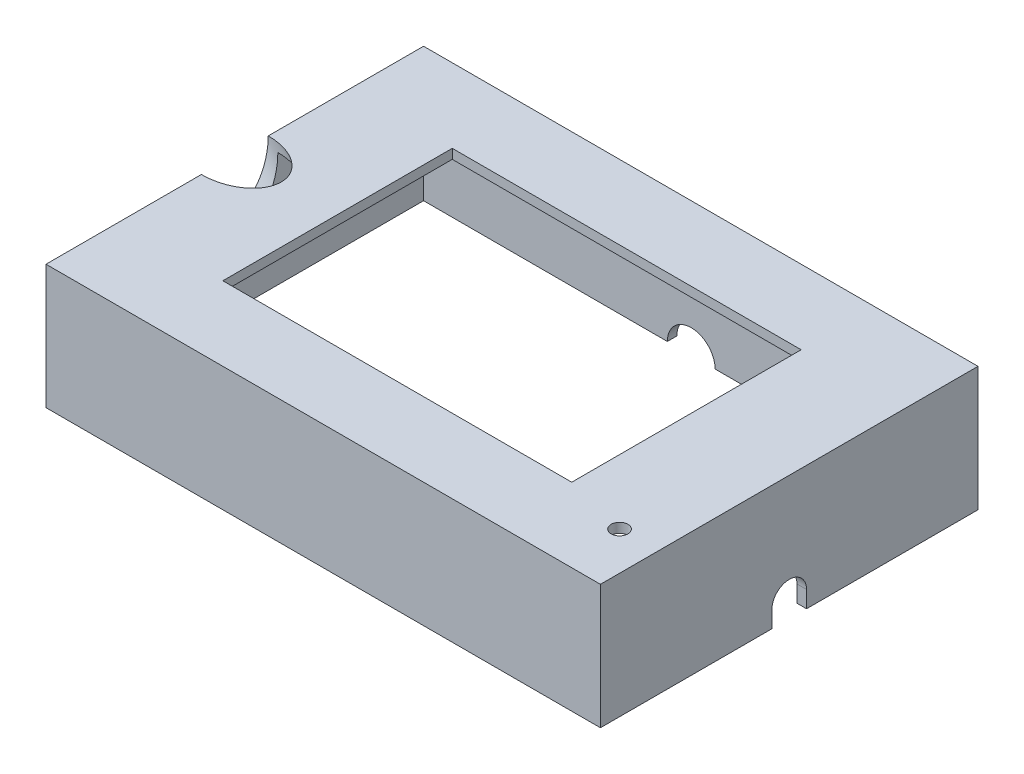
ISO-10303-21;
HEADER;
FILE_DESCRIPTION(('STEP AP214'),'2;1');
FILE_NAME('part.step','',(''),(''),'','','');
FILE_SCHEMA(('AUTOMOTIVE_DESIGN { 1 0 10303 214 1 1 1 1 }'));
ENDSEC;
DATA;
#1=APPLICATION_CONTEXT('core data for automotive mechanical design processes');
#2=APPLICATION_PROTOCOL_DEFINITION('international standard','automotive_design',2000,#1);
#3=PRODUCT_CONTEXT('',#1,'mechanical');
#4=PRODUCT('Part','Part','',(#3));
#5=PRODUCT_RELATED_PRODUCT_CATEGORY('part','',(#4));
#6=PRODUCT_DEFINITION_FORMATION('','',#4);
#7=PRODUCT_DEFINITION_CONTEXT('part definition',#1,'design');
#8=PRODUCT_DEFINITION('design','',#6,#7);
#9=PRODUCT_DEFINITION_SHAPE('','',#8);
#10=(LENGTH_UNIT() NAMED_UNIT(*) SI_UNIT(.MILLI.,.METRE.));
#11=(NAMED_UNIT(*) PLANE_ANGLE_UNIT() SI_UNIT($,.RADIAN.));
#12=(NAMED_UNIT(*) SI_UNIT($,.STERADIAN.) SOLID_ANGLE_UNIT());
#13=UNCERTAINTY_MEASURE_WITH_UNIT(LENGTH_MEASURE(1.E-05),#10,'distance_accuracy_value','');
#14=(GEOMETRIC_REPRESENTATION_CONTEXT(3) GLOBAL_UNCERTAINTY_ASSIGNED_CONTEXT((#13)) GLOBAL_UNIT_ASSIGNED_CONTEXT((#10,
#11,#12)) REPRESENTATION_CONTEXT('',''));
#15=CARTESIAN_POINT('',(0.,0.,0.));
#16=DIRECTION('',(0.,0.,1.));
#17=DIRECTION('',(1.,0.,0.));
#18=AXIS2_PLACEMENT_3D('',#15,#16,#17);
#19=CARTESIAN_POINT('',(0.,0.,0.));
#20=DIRECTION('',(0.,1.,0.));
#21=DIRECTION('',(0.,0.,1.));
#22=AXIS2_PLACEMENT_3D('',#19,#20,#21);
#23=PLANE('',#22);
#24=DIRECTION('',(-1.,0.,0.));
#25=VECTOR('',#24,1.);
#26=CARTESIAN_POINT('',(56.,0.,-37.5));
#27=LINE('',#26,#25);
#28=CARTESIAN_POINT('',(56.,0.,-37.5));
#29=VERTEX_POINT('',#28);
#30=CARTESIAN_POINT('',(5.,0.,-37.5));
#31=VERTEX_POINT('',#30);
#32=EDGE_CURVE('E313',#29,#31,#27,.T.);
#33=ORIENTED_EDGE('',*,*,#32,.T.);
#34=DIRECTION('',(0.,0.,-1.));
#35=VECTOR('',#34,1.);
#36=CARTESIAN_POINT('',(5.,0.,-23.357864376269));
#37=LINE('',#36,#35);
#38=CARTESIAN_POINT('',(5.,0.,-39.5));
#39=VERTEX_POINT('',#38);
#40=EDGE_CURVE('E47',#31,#39,#37,.T.);
#41=ORIENTED_EDGE('',*,*,#40,.T.);
#42=DIRECTION('',(-1.,0.,0.));
#43=VECTOR('',#42,1.);
#44=CARTESIAN_POINT('',(58.,0.,-39.5));
#45=LINE('',#44,#43);
#46=CARTESIAN_POINT('',(58.,0.,-39.5));
#47=VERTEX_POINT('',#46);
#48=EDGE_CURVE('E188',#47,#39,#45,.T.);
#49=ORIENTED_EDGE('',*,*,#48,.F.);
#50=DIRECTION('',(0.,0.,-1.));
#51=VECTOR('',#50,1.);
#52=CARTESIAN_POINT('',(58.,0.,39.5));
#53=LINE('',#52,#51);
#54=CARTESIAN_POINT('',(58.,0.,-3.625));
#55=VERTEX_POINT('',#54);
#56=EDGE_CURVE('E197',#55,#47,#53,.T.);
#57=ORIENTED_EDGE('',*,*,#56,.F.);
#58=DIRECTION('',(1.,0.,0.));
#59=VECTOR('',#58,1.);
#60=CARTESIAN_POINT('',(45.834955730544,0.,-3.625));
#61=LINE('',#60,#59);
#62=CARTESIAN_POINT('',(56.,0.,-3.625));
#63=VERTEX_POINT('',#62);
#64=EDGE_CURVE('E350',#63,#55,#61,.T.);
#65=ORIENTED_EDGE('',*,*,#64,.F.);
#66=DIRECTION('',(0.,0.,-1.));
#67=VECTOR('',#66,1.);
#68=CARTESIAN_POINT('',(56.,0.,37.5));
#69=LINE('',#68,#67);
#70=EDGE_CURVE('E308',#63,#29,#69,.T.);
#71=ORIENTED_EDGE('',*,*,#70,.T.);
#72=EDGE_LOOP('',(#33,#41,#49,#57,#65,#71));
#73=FACE_BOUND('',#72,.T.);
#74=ADVANCED_FACE('F33',(#73),#23,.F.);
#75=CARTESIAN_POINT('',(-58.,24.,39.5));
#76=DIRECTION('',(1.,0.,0.));
#77=DIRECTION('',(0.,0.,-1.));
#78=AXIS2_PLACEMENT_3D('',#75,#76,#77);
#79=PLANE('',#78);
#80=CARTESIAN_POINT('',(-58.,26.,0.));
#81=DIRECTION('',(1.,0.,0.));
#82=DIRECTION('',(0.,1.,0.));
#83=AXIS2_PLACEMENT_3D('',#80,#81,#82);
#84=ELLIPSE('',#83,10.0916656690722,7.);
#85=CARTESIAN_POINT('',(-58.,26.,-7.));
#86=VERTEX_POINT('',#85);
#87=CARTESIAN_POINT('',(-58.,26.,7.));
#88=VERTEX_POINT('',#87);
#89=EDGE_CURVE('E231',#86,#88,#84,.F.);
#90=ORIENTED_EDGE('',*,*,#89,.F.);
#91=DIRECTION('',(0.,0.,1.));
#92=VECTOR('',#91,1.);
#93=CARTESIAN_POINT('',(-58.,26.,39.5));
#94=LINE('',#93,#92);
#95=CARTESIAN_POINT('',(-58.,26.,-39.5));
#96=VERTEX_POINT('',#95);
#97=EDGE_CURVE('E278',#96,#86,#94,.T.);
#98=ORIENTED_EDGE('',*,*,#97,.F.);
#99=DIRECTION('',(0.,-1.,0.));
#100=VECTOR('',#99,1.);
#101=CARTESIAN_POINT('',(-58.,24.,-39.5));
#102=LINE('',#101,#100);
#103=CARTESIAN_POINT('',(-58.,0.,-39.5));
#104=VERTEX_POINT('',#103);
#105=EDGE_CURVE('E210',#96,#104,#102,.T.);
#106=ORIENTED_EDGE('',*,*,#105,.T.);
#107=DIRECTION('',(0.,0.,1.));
#108=VECTOR('',#107,1.);
#109=CARTESIAN_POINT('',(-58.,0.,39.5));
#110=LINE('',#109,#108);
#111=CARTESIAN_POINT('',(-58.,0.,39.5));
#112=VERTEX_POINT('',#111);
#113=EDGE_CURVE('E193',#104,#112,#110,.T.);
#114=ORIENTED_EDGE('',*,*,#113,.T.);
#115=DIRECTION('',(0.,-1.,0.));
#116=VECTOR('',#115,1.);
#117=CARTESIAN_POINT('',(-58.,24.,39.5));
#118=LINE('',#117,#116);
#119=CARTESIAN_POINT('',(-58.,26.,39.5));
#120=VERTEX_POINT('',#119);
#121=EDGE_CURVE('E207',#120,#112,#118,.T.);
#122=ORIENTED_EDGE('',*,*,#121,.F.);
#123=EDGE_CURVE('E277',#88,#120,#94,.T.);
#124=ORIENTED_EDGE('',*,*,#123,.F.);
#125=EDGE_LOOP('',(#90,#98,#106,#114,#122,#124));
#126=FACE_BOUND('',#125,.T.);
#127=ADVANCED_FACE('F341',(#126),#79,.F.);
#128=CARTESIAN_POINT('',(-56.,24.,37.5));
#129=DIRECTION('',(1.,0.,0.));
#130=DIRECTION('',(0.,0.,-1.));
#131=AXIS2_PLACEMENT_3D('',#128,#129,#130);
#132=PLANE('',#131);
#133=DIRECTION('',(0.,0.,1.));
#134=VECTOR('',#133,1.);
#135=CARTESIAN_POINT('',(-56.,24.,37.5));
#136=LINE('',#135,#134);
#137=CARTESIAN_POINT('',(-56.,24.,-37.5));
#138=VERTEX_POINT('',#137);
#139=CARTESIAN_POINT('',(-56.,24.,-6.9997966416826));
#140=VERTEX_POINT('',#139);
#141=EDGE_CURVE('E236',#138,#140,#136,.T.);
#142=ORIENTED_EDGE('',*,*,#141,.T.);
#143=CARTESIAN_POINT('',(-56.,23.9230769230769,0.));
#144=DIRECTION('',(1.,0.,0.));
#145=DIRECTION('',(0.,1.,0.));
#146=AXIS2_PLACEMENT_3D('',#143,#144,#145);
#147=ELLIPSE('',#146,10.0916656690722,7.);
#148=CARTESIAN_POINT('',(-56.,14.0432112488953,-1.42660532785244));
#149=VERTEX_POINT('',#148);
#150=EDGE_CURVE('E228',#140,#149,#147,.F.);
#151=ORIENTED_EDGE('',*,*,#150,.T.);
#152=DIRECTION('',(0.,0.,-1.));
#153=VECTOR('',#152,1.);
#154=CARTESIAN_POINT('',(-56.,14.0432112488953,37.5));
#155=LINE('',#154,#153);
#156=CARTESIAN_POINT('',(-56.,14.0432112488953,1.42660532785244));
#157=VERTEX_POINT('',#156);
#158=EDGE_CURVE('E41',#157,#149,#155,.T.);
#159=ORIENTED_EDGE('',*,*,#158,.F.);
#160=CARTESIAN_POINT('',(-56.,24.,6.9997966416826));
#161=VERTEX_POINT('',#160);
#162=EDGE_CURVE('E230',#157,#161,#147,.F.);
#163=ORIENTED_EDGE('',*,*,#162,.T.);
#164=CARTESIAN_POINT('',(-56.,24.,37.5));
#165=VERTEX_POINT('',#164);
#166=EDGE_CURVE('E293',#161,#165,#136,.T.);
#167=ORIENTED_EDGE('',*,*,#166,.T.);
#168=DIRECTION('',(0.,-1.,0.));
#169=VECTOR('',#168,1.);
#170=CARTESIAN_POINT('',(-56.,24.,37.5));
#171=LINE('',#170,#169);
#172=CARTESIAN_POINT('',(-56.,0.,37.5));
#173=VERTEX_POINT('',#172);
#174=EDGE_CURVE('E322',#165,#173,#171,.T.);
#175=ORIENTED_EDGE('',*,*,#174,.T.);
#176=DIRECTION('',(0.,0.,1.));
#177=VECTOR('',#176,1.);
#178=CARTESIAN_POINT('',(-56.,0.,37.5));
#179=LINE('',#178,#177);
#180=CARTESIAN_POINT('',(-56.,0.,-37.5));
#181=VERTEX_POINT('',#180);
#182=EDGE_CURVE('E290',#181,#173,#179,.T.);
#183=ORIENTED_EDGE('',*,*,#182,.F.);
#184=DIRECTION('',(0.,-1.,0.));
#185=VECTOR('',#184,1.);
#186=CARTESIAN_POINT('',(-56.,24.,-37.5));
#187=LINE('',#186,#185);
#188=EDGE_CURVE('E302',#138,#181,#187,.T.);
#189=ORIENTED_EDGE('',*,*,#188,.F.);
#190=EDGE_LOOP('',(#142,#151,#159,#163,#167,#175,#183,#189));
#191=FACE_BOUND('',#190,.T.);
#192=ADVANCED_FACE('F234',(#191),#132,.T.);
#193=CARTESIAN_POINT('',(0.,24.,0.));
#194=DIRECTION('',(0.,1.,0.));
#195=DIRECTION('',(0.,0.,1.));
#196=AXIS2_PLACEMENT_3D('',#193,#194,#195);
#197=PLANE('',#196);
#198=DIRECTION('',(-1.,0.,0.));
#199=VECTOR('',#198,1.);
#200=CARTESIAN_POINT('',(-36.5,24.,24.));
#201=LINE('',#200,#199);
#202=CARTESIAN_POINT('',(36.5,24.,24.));
#203=VERTEX_POINT('',#202);
#204=CARTESIAN_POINT('',(-36.5,24.,24.));
#205=VERTEX_POINT('',#204);
#206=EDGE_CURVE('E252',#203,#205,#201,.T.);
#207=ORIENTED_EDGE('',*,*,#206,.F.);
#208=DIRECTION('',(0.,0.,1.));
#209=VECTOR('',#208,1.);
#210=CARTESIAN_POINT('',(36.5,24.,-24.));
#211=LINE('',#210,#209);
#212=CARTESIAN_POINT('',(36.5,24.,-24.));
#213=VERTEX_POINT('',#212);
#214=EDGE_CURVE('E255',#213,#203,#211,.T.);
#215=ORIENTED_EDGE('',*,*,#214,.F.);
#216=DIRECTION('',(1.,0.,0.));
#217=VECTOR('',#216,1.);
#218=CARTESIAN_POINT('',(-36.5,24.,-24.));
#219=LINE('',#218,#217);
#220=CARTESIAN_POINT('',(-36.5,24.,-24.));
#221=VERTEX_POINT('',#220);
#222=EDGE_CURVE('E257',#221,#213,#219,.T.);
#223=ORIENTED_EDGE('',*,*,#222,.F.);
#224=DIRECTION('',(0.,0.,-1.));
#225=VECTOR('',#224,1.);
#226=CARTESIAN_POINT('',(-36.5,24.,-24.));
#227=LINE('',#226,#225);
#228=EDGE_CURVE('E249',#205,#221,#227,.T.);
#229=ORIENTED_EDGE('',*,*,#228,.F.);
#230=EDGE_LOOP('',(#207,#215,#223,#229));
#231=FACE_BOUND('',#230,.T.);
#232=CARTESIAN_POINT('',(50.,24.,27.5));
#233=DIRECTION('',(0.,1.,0.));
#234=DIRECTION('',(0.,0.,1.));
#235=AXIS2_PLACEMENT_3D('',#232,#233,#234);
#236=CIRCLE('',#235,1.75);
#237=CARTESIAN_POINT('',(50.,24.,29.25));
#238=VERTEX_POINT('',#237);
#239=EDGE_CURVE('E240',#238,#238,#236,.F.);
#240=ORIENTED_EDGE('',*,*,#239,.F.);
#241=EDGE_LOOP('',(#240));
#242=FACE_BOUND('',#241,.T.);
#243=CARTESIAN_POINT('',(-56.0740740740741,24.,0.));
#244=DIRECTION('',(0.,1.,0.));
#245=DIRECTION('',(-1.,0.,0.));
#246=AXIS2_PLACEMENT_3D('',#243,#244,#245);
#247=ELLIPSE('',#246,9.71790027392142,7.);
#248=EDGE_CURVE('E242',#140,#161,#247,.F.);
#249=ORIENTED_EDGE('',*,*,#248,.F.);
#250=ORIENTED_EDGE('',*,*,#141,.F.);
#251=DIRECTION('',(-1.,0.,0.));
#252=VECTOR('',#251,1.);
#253=CARTESIAN_POINT('',(56.,24.,-37.5));
#254=LINE('',#253,#252);
#255=CARTESIAN_POINT('',(56.,24.,-37.5));
#256=VERTEX_POINT('',#255);
#257=EDGE_CURVE('E299',#256,#138,#254,.T.);
#258=ORIENTED_EDGE('',*,*,#257,.F.);
#259=DIRECTION('',(0.,0.,-1.));
#260=VECTOR('',#259,1.);
#261=CARTESIAN_POINT('',(56.,24.,37.5));
#262=LINE('',#261,#260);
#263=CARTESIAN_POINT('',(56.,24.,37.5));
#264=VERTEX_POINT('',#263);
#265=EDGE_CURVE('E296',#264,#256,#262,.T.);
#266=ORIENTED_EDGE('',*,*,#265,.F.);
#267=DIRECTION('',(1.,0.,0.));
#268=VECTOR('',#267,1.);
#269=CARTESIAN_POINT('',(56.,24.,37.5));
#270=LINE('',#269,#268);
#271=EDGE_CURVE('E292',#165,#264,#270,.T.);
#272=ORIENTED_EDGE('',*,*,#271,.F.);
#273=ORIENTED_EDGE('',*,*,#166,.F.);
#274=EDGE_LOOP('',(#249,#250,#258,#266,#272,#273));
#275=FACE_BOUND('',#274,.T.);
#276=ADVANCED_FACE('F386',(#231,#242,#275),#197,.F.);
#277=CARTESIAN_POINT('',(0.,26.,0.));
#278=DIRECTION('',(0.,1.,0.));
#279=DIRECTION('',(0.,0.,1.));
#280=AXIS2_PLACEMENT_3D('',#277,#278,#279);
#281=PLANE('',#280);
#282=DIRECTION('',(0.,0.,-1.));
#283=VECTOR('',#282,1.);
#284=CARTESIAN_POINT('',(36.5,26.,-24.));
#285=LINE('',#284,#283);
#286=CARTESIAN_POINT('',(36.5,26.,24.));
#287=VERTEX_POINT('',#286);
#288=CARTESIAN_POINT('',(36.5,26.,-24.));
#289=VERTEX_POINT('',#288);
#290=EDGE_CURVE('E248',#287,#289,#285,.T.);
#291=ORIENTED_EDGE('',*,*,#290,.F.);
#292=DIRECTION('',(1.,0.,0.));
#293=VECTOR('',#292,1.);
#294=CARTESIAN_POINT('',(-36.5,26.,24.));
#295=LINE('',#294,#293);
#296=CARTESIAN_POINT('',(-36.5,26.,24.));
#297=VERTEX_POINT('',#296);
#298=EDGE_CURVE('E265',#297,#287,#295,.T.);
#299=ORIENTED_EDGE('',*,*,#298,.F.);
#300=DIRECTION('',(0.,0.,1.));
#301=VECTOR('',#300,1.);
#302=CARTESIAN_POINT('',(-36.5,26.,-24.));
#303=LINE('',#302,#301);
#304=CARTESIAN_POINT('',(-36.5,26.,-24.));
#305=VERTEX_POINT('',#304);
#306=EDGE_CURVE('E262',#305,#297,#303,.T.);
#307=ORIENTED_EDGE('',*,*,#306,.F.);
#308=DIRECTION('',(-1.,0.,0.));
#309=VECTOR('',#308,1.);
#310=CARTESIAN_POINT('',(-36.5,26.,-24.));
#311=LINE('',#310,#309);
#312=EDGE_CURVE('E259',#289,#305,#311,.T.);
#313=ORIENTED_EDGE('',*,*,#312,.F.);
#314=EDGE_LOOP('',(#291,#299,#307,#313));
#315=FACE_BOUND('',#314,.T.);
#316=CARTESIAN_POINT('',(50.,26.,27.5));
#317=DIRECTION('',(0.,1.,0.));
#318=DIRECTION('',(0.,0.,1.));
#319=AXIS2_PLACEMENT_3D('',#316,#317,#318);
#320=CIRCLE('',#319,1.75);
#321=CARTESIAN_POINT('',(50.,26.,29.25));
#322=VERTEX_POINT('',#321);
#323=EDGE_CURVE('E237',#322,#322,#320,.T.);
#324=ORIENTED_EDGE('',*,*,#323,.F.);
#325=EDGE_LOOP('',(#324));
#326=FACE_BOUND('',#325,.T.);
#327=ORIENTED_EDGE('',*,*,#97,.T.);
#328=CARTESIAN_POINT('',(-58.,26.,0.));
#329=DIRECTION('',(0.,1.,0.));
#330=DIRECTION('',(-1.,0.,0.));
#331=AXIS2_PLACEMENT_3D('',#328,#329,#330);
#332=ELLIPSE('',#331,9.71790027392142,7.);
#333=EDGE_CURVE('E214',#86,#88,#332,.F.);
#334=ORIENTED_EDGE('',*,*,#333,.T.);
#335=ORIENTED_EDGE('',*,*,#123,.T.);
#336=DIRECTION('',(1.,0.,0.));
#337=VECTOR('',#336,1.);
#338=CARTESIAN_POINT('',(58.,26.,39.5));
#339=LINE('',#338,#337);
#340=CARTESIAN_POINT('',(58.,26.,39.5));
#341=VERTEX_POINT('',#340);
#342=EDGE_CURVE('E281',#120,#341,#339,.T.);
#343=ORIENTED_EDGE('',*,*,#342,.T.);
#344=DIRECTION('',(0.,0.,-1.));
#345=VECTOR('',#344,1.);
#346=CARTESIAN_POINT('',(58.,26.,39.5));
#347=LINE('',#346,#345);
#348=CARTESIAN_POINT('',(58.,26.,-39.5));
#349=VERTEX_POINT('',#348);
#350=EDGE_CURVE('E284',#341,#349,#347,.T.);
#351=ORIENTED_EDGE('',*,*,#350,.T.);
#352=DIRECTION('',(-1.,0.,0.));
#353=VECTOR('',#352,1.);
#354=CARTESIAN_POINT('',(58.,26.,-39.5));
#355=LINE('',#354,#353);
#356=EDGE_CURVE('E287',#349,#96,#355,.T.);
#357=ORIENTED_EDGE('',*,*,#356,.T.);
#358=EDGE_LOOP('',(#327,#334,#335,#343,#351,#357));
#359=FACE_BOUND('',#358,.T.);
#360=ADVANCED_FACE('F338',(#315,#326,#359),#281,.T.);
#361=CARTESIAN_POINT('',(-5.,0.,-39.5));
#362=VERTEX_POINT('',#361);
#363=EDGE_CURVE('E184',#362,#104,#45,.T.);
#364=ORIENTED_EDGE('',*,*,#363,.F.);
#365=DIRECTION('',(0.,0.,-1.));
#366=VECTOR('',#365,1.);
#367=CARTESIAN_POINT('',(-5.,0.,-23.357864376269));
#368=LINE('',#367,#366);
#369=CARTESIAN_POINT('',(-5.,0.,-37.5));
#370=VERTEX_POINT('',#369);
#371=EDGE_CURVE('E173',#362,#370,#368,.F.);
#372=ORIENTED_EDGE('',*,*,#371,.T.);
#373=EDGE_CURVE('E312',#370,#181,#27,.T.);
#374=ORIENTED_EDGE('',*,*,#373,.T.);
#375=ORIENTED_EDGE('',*,*,#182,.T.);
#376=DIRECTION('',(1.,0.,0.));
#377=VECTOR('',#376,1.);
#378=CARTESIAN_POINT('',(56.,0.,37.5));
#379=LINE('',#378,#377);
#380=CARTESIAN_POINT('',(56.,0.,37.5));
#381=VERTEX_POINT('',#380);
#382=EDGE_CURVE('E305',#173,#381,#379,.T.);
#383=ORIENTED_EDGE('',*,*,#382,.T.);
#384=CARTESIAN_POINT('',(56.,0.,3.625));
#385=VERTEX_POINT('',#384);
#386=EDGE_CURVE('E309',#381,#385,#69,.T.);
#387=ORIENTED_EDGE('',*,*,#386,.T.);
#388=DIRECTION('',(1.,0.,0.));
#389=VECTOR('',#388,1.);
#390=CARTESIAN_POINT('',(45.834955730544,0.,3.625));
#391=LINE('',#390,#389);
#392=CARTESIAN_POINT('',(58.,0.,3.625));
#393=VERTEX_POINT('',#392);
#394=EDGE_CURVE('E347',#385,#393,#391,.T.);
#395=ORIENTED_EDGE('',*,*,#394,.T.);
#396=CARTESIAN_POINT('',(58.,0.,39.5));
#397=VERTEX_POINT('',#396);
#398=EDGE_CURVE('E194',#397,#393,#53,.T.);
#399=ORIENTED_EDGE('',*,*,#398,.F.);
#400=DIRECTION('',(1.,0.,0.));
#401=VECTOR('',#400,1.);
#402=CARTESIAN_POINT('',(58.,0.,39.5));
#403=LINE('',#402,#401);
#404=EDGE_CURVE('E202',#112,#397,#403,.T.);
#405=ORIENTED_EDGE('',*,*,#404,.F.);
#406=ORIENTED_EDGE('',*,*,#113,.F.);
#407=EDGE_LOOP('',(#364,#372,#374,#375,#383,#387,#395,#399,#405,#406));
#408=FACE_BOUND('',#407,.T.);
#409=ADVANCED_FACE('F191',(#408),#23,.F.);
#410=CARTESIAN_POINT('',(58.,24.,39.5));
#411=DIRECTION('',(-1.,0.,0.));
#412=DIRECTION('',(0.,0.,1.));
#413=AXIS2_PLACEMENT_3D('',#410,#411,#412);
#414=PLANE('',#413);
#415=ORIENTED_EDGE('',*,*,#398,.T.);
#416=DIRECTION('',(0.,-1.,0.));
#417=VECTOR('',#416,1.);
#418=CARTESIAN_POINT('',(58.,3.5,3.625));
#419=LINE('',#418,#417);
#420=CARTESIAN_POINT('',(58.,3.5,3.625));
#421=VERTEX_POINT('',#420);
#422=EDGE_CURVE('E364',#421,#393,#419,.T.);
#423=ORIENTED_EDGE('',*,*,#422,.F.);
#424=CARTESIAN_POINT('',(58.,3.5,0.));
#425=DIRECTION('',(1.,0.,0.));
#426=DIRECTION('',(0.,0.,-1.));
#427=AXIS2_PLACEMENT_3D('',#424,#425,#426);
#428=CIRCLE('',#427,3.625);
#429=CARTESIAN_POINT('',(58.,3.5,-3.625));
#430=VERTEX_POINT('',#429);
#431=EDGE_CURVE('E362',#430,#421,#428,.T.);
#432=ORIENTED_EDGE('',*,*,#431,.F.);
#433=DIRECTION('',(0.,1.,0.));
#434=VECTOR('',#433,1.);
#435=CARTESIAN_POINT('',(58.,3.5,-3.625));
#436=LINE('',#435,#434);
#437=EDGE_CURVE('E332',#55,#430,#436,.T.);
#438=ORIENTED_EDGE('',*,*,#437,.F.);
#439=ORIENTED_EDGE('',*,*,#56,.T.);
#440=DIRECTION('',(0.,-1.,0.));
#441=VECTOR('',#440,1.);
#442=CARTESIAN_POINT('',(58.,24.,-39.5));
#443=LINE('',#442,#441);
#444=EDGE_CURVE('E212',#349,#47,#443,.T.);
#445=ORIENTED_EDGE('',*,*,#444,.F.);
#446=ORIENTED_EDGE('',*,*,#350,.F.);
#447=DIRECTION('',(0.,-1.,0.));
#448=VECTOR('',#447,1.);
#449=CARTESIAN_POINT('',(58.,24.,39.5));
#450=LINE('',#449,#448);
#451=EDGE_CURVE('E204',#341,#397,#450,.T.);
#452=ORIENTED_EDGE('',*,*,#451,.T.);
#453=EDGE_LOOP('',(#415,#423,#432,#438,#439,#445,#446,#452));
#454=FACE_BOUND('',#453,.T.);
#455=ADVANCED_FACE('F35',(#454),#414,.F.);
#456=CARTESIAN_POINT('',(58.,24.,-39.5));
#457=DIRECTION('',(0.,0.,1.));
#458=DIRECTION('',(1.,0.,0.));
#459=AXIS2_PLACEMENT_3D('',#456,#457,#458);
#460=PLANE('',#459);
#461=ORIENTED_EDGE('',*,*,#48,.T.);
#462=CARTESIAN_POINT('',(0.,0.,-39.5));
#463=DIRECTION('',(0.,0.,-1.));
#464=DIRECTION('',(-1.,0.,0.));
#465=AXIS2_PLACEMENT_3D('',#462,#463,#464);
#466=CIRCLE('',#465,5.);
#467=EDGE_CURVE('E176',#362,#39,#466,.T.);
#468=ORIENTED_EDGE('',*,*,#467,.F.);
#469=ORIENTED_EDGE('',*,*,#363,.T.);
#470=ORIENTED_EDGE('',*,*,#105,.F.);
#471=ORIENTED_EDGE('',*,*,#356,.F.);
#472=ORIENTED_EDGE('',*,*,#444,.T.);
#473=EDGE_LOOP('',(#461,#468,#469,#470,#471,#472));
#474=FACE_BOUND('',#473,.T.);
#475=ADVANCED_FACE('F183',(#474),#460,.F.);
#476=CARTESIAN_POINT('',(58.,24.,39.5));
#477=DIRECTION('',(0.,0.,-1.));
#478=DIRECTION('',(-1.,0.,0.));
#479=AXIS2_PLACEMENT_3D('',#476,#477,#478);
#480=PLANE('',#479);
#481=ORIENTED_EDGE('',*,*,#404,.T.);
#482=ORIENTED_EDGE('',*,*,#451,.F.);
#483=ORIENTED_EDGE('',*,*,#342,.F.);
#484=ORIENTED_EDGE('',*,*,#121,.T.);
#485=EDGE_LOOP('',(#481,#482,#483,#484));
#486=FACE_BOUND('',#485,.T.);
#487=ADVANCED_FACE('F414',(#486),#480,.F.);
#488=CARTESIAN_POINT('',(56.,24.,37.5));
#489=DIRECTION('',(0.,0.,-1.));
#490=DIRECTION('',(-1.,0.,0.));
#491=AXIS2_PLACEMENT_3D('',#488,#489,#490);
#492=PLANE('',#491);
#493=ORIENTED_EDGE('',*,*,#382,.F.);
#494=ORIENTED_EDGE('',*,*,#174,.F.);
#495=ORIENTED_EDGE('',*,*,#271,.T.);
#496=DIRECTION('',(0.,-1.,0.));
#497=VECTOR('',#496,1.);
#498=CARTESIAN_POINT('',(56.,24.,37.5));
#499=LINE('',#498,#497);
#500=EDGE_CURVE('E321',#264,#381,#499,.T.);
#501=ORIENTED_EDGE('',*,*,#500,.T.);
#502=EDGE_LOOP('',(#493,#494,#495,#501));
#503=FACE_BOUND('',#502,.T.);
#504=ADVANCED_FACE('F382',(#503),#492,.T.);
#505=CARTESIAN_POINT('',(56.,24.,37.5));
#506=DIRECTION('',(-1.,0.,0.));
#507=DIRECTION('',(0.,0.,1.));
#508=AXIS2_PLACEMENT_3D('',#505,#506,#507);
#509=PLANE('',#508);
#510=DIRECTION('',(0.,-1.,0.));
#511=VECTOR('',#510,1.);
#512=CARTESIAN_POINT('',(56.,3.5,3.625));
#513=LINE('',#512,#511);
#514=CARTESIAN_POINT('',(56.,3.5,3.625));
#515=VERTEX_POINT('',#514);
#516=EDGE_CURVE('E351',#515,#385,#513,.T.);
#517=ORIENTED_EDGE('',*,*,#516,.T.);
#518=ORIENTED_EDGE('',*,*,#386,.F.);
#519=ORIENTED_EDGE('',*,*,#500,.F.);
#520=ORIENTED_EDGE('',*,*,#265,.T.);
#521=DIRECTION('',(0.,-1.,0.));
#522=VECTOR('',#521,1.);
#523=CARTESIAN_POINT('',(56.,24.,-37.5));
#524=LINE('',#523,#522);
#525=EDGE_CURVE('E318',#256,#29,#524,.T.);
#526=ORIENTED_EDGE('',*,*,#525,.T.);
#527=ORIENTED_EDGE('',*,*,#70,.F.);
#528=DIRECTION('',(0.,1.,0.));
#529=VECTOR('',#528,1.);
#530=CARTESIAN_POINT('',(56.,3.5,-3.625));
#531=LINE('',#530,#529);
#532=CARTESIAN_POINT('',(56.,3.5,-3.625));
#533=VERTEX_POINT('',#532);
#534=EDGE_CURVE('E353',#63,#533,#531,.T.);
#535=ORIENTED_EDGE('',*,*,#534,.T.);
#536=CARTESIAN_POINT('',(56.,3.5,0.));
#537=DIRECTION('',(-1.,0.,0.));
#538=DIRECTION('',(0.,0.,1.));
#539=AXIS2_PLACEMENT_3D('',#536,#537,#538);
#540=CIRCLE('',#539,3.625);
#541=EDGE_CURVE('E346',#533,#515,#540,.F.);
#542=ORIENTED_EDGE('',*,*,#541,.T.);
#543=EDGE_LOOP('',(#517,#518,#519,#520,#526,#527,#535,#542));
#544=FACE_BOUND('',#543,.T.);
#545=ADVANCED_FACE('F373',(#544),#509,.T.);
#546=CARTESIAN_POINT('',(56.,24.,-37.5));
#547=DIRECTION('',(0.,0.,1.));
#548=DIRECTION('',(1.,0.,0.));
#549=AXIS2_PLACEMENT_3D('',#546,#547,#548);
#550=PLANE('',#549);
#551=CARTESIAN_POINT('',(0.,0.,-37.5));
#552=DIRECTION('',(0.,0.,1.));
#553=DIRECTION('',(1.,0.,0.));
#554=AXIS2_PLACEMENT_3D('',#551,#552,#553);
#555=CIRCLE('',#554,5.);
#556=EDGE_CURVE('E11',#31,#370,#555,.T.);
#557=ORIENTED_EDGE('',*,*,#556,.F.);
#558=ORIENTED_EDGE('',*,*,#32,.F.);
#559=ORIENTED_EDGE('',*,*,#525,.F.);
#560=ORIENTED_EDGE('',*,*,#257,.T.);
#561=ORIENTED_EDGE('',*,*,#188,.T.);
#562=ORIENTED_EDGE('',*,*,#373,.F.);
#563=EDGE_LOOP('',(#557,#558,#559,#560,#561,#562));
#564=FACE_BOUND('',#563,.T.);
#565=ADVANCED_FACE('F380',(#564),#550,.T.);
#566=CARTESIAN_POINT('',(36.5,-63.3670418407308,-24.));
#567=DIRECTION('',(1.,0.,0.));
#568=DIRECTION('',(0.,0.,-1.));
#569=AXIS2_PLACEMENT_3D('',#566,#567,#568);
#570=PLANE('',#569);
#571=ORIENTED_EDGE('',*,*,#214,.T.);
#572=DIRECTION('',(0.,1.,0.));
#573=VECTOR('',#572,1.);
#574=CARTESIAN_POINT('',(36.5,-63.3670418407308,24.));
#575=LINE('',#574,#573);
#576=EDGE_CURVE('E253',#203,#287,#575,.T.);
#577=ORIENTED_EDGE('',*,*,#576,.T.);
#578=ORIENTED_EDGE('',*,*,#290,.T.);
#579=DIRECTION('',(0.,1.,0.));
#580=VECTOR('',#579,1.);
#581=CARTESIAN_POINT('',(36.5,-63.3670418407308,-24.));
#582=LINE('',#581,#580);
#583=EDGE_CURVE('E268',#213,#289,#582,.T.);
#584=ORIENTED_EDGE('',*,*,#583,.F.);
#585=EDGE_LOOP('',(#571,#577,#578,#584));
#586=FACE_BOUND('',#585,.T.);
#587=ADVANCED_FACE('F448',(#586),#570,.F.);
#588=CARTESIAN_POINT('',(-36.5,-63.3670418407308,24.));
#589=DIRECTION('',(0.,0.,1.));
#590=DIRECTION('',(1.,0.,0.));
#591=AXIS2_PLACEMENT_3D('',#588,#589,#590);
#592=PLANE('',#591);
#593=ORIENTED_EDGE('',*,*,#206,.T.);
#594=DIRECTION('',(0.,1.,0.));
#595=VECTOR('',#594,1.);
#596=CARTESIAN_POINT('',(-36.5,-63.3670418407308,24.));
#597=LINE('',#596,#595);
#598=EDGE_CURVE('E270',#205,#297,#597,.T.);
#599=ORIENTED_EDGE('',*,*,#598,.T.);
#600=ORIENTED_EDGE('',*,*,#298,.T.);
#601=ORIENTED_EDGE('',*,*,#576,.F.);
#602=EDGE_LOOP('',(#593,#599,#600,#601));
#603=FACE_BOUND('',#602,.T.);
#604=ADVANCED_FACE('F444',(#603),#592,.F.);
#605=CARTESIAN_POINT('',(-36.5,-63.3670418407308,-24.));
#606=DIRECTION('',(-1.,0.,0.));
#607=DIRECTION('',(0.,0.,1.));
#608=AXIS2_PLACEMENT_3D('',#605,#606,#607);
#609=PLANE('',#608);
#610=ORIENTED_EDGE('',*,*,#228,.T.);
#611=DIRECTION('',(0.,1.,0.));
#612=VECTOR('',#611,1.);
#613=CARTESIAN_POINT('',(-36.5,-63.3670418407308,-24.));
#614=LINE('',#613,#612);
#615=EDGE_CURVE('E272',#221,#305,#614,.T.);
#616=ORIENTED_EDGE('',*,*,#615,.T.);
#617=ORIENTED_EDGE('',*,*,#306,.T.);
#618=ORIENTED_EDGE('',*,*,#598,.F.);
#619=EDGE_LOOP('',(#610,#616,#617,#618));
#620=FACE_BOUND('',#619,.T.);
#621=ADVANCED_FACE('F447',(#620),#609,.F.);
#622=CARTESIAN_POINT('',(-36.5,-63.3670418407308,-24.));
#623=DIRECTION('',(0.,0.,-1.));
#624=DIRECTION('',(-1.,0.,0.));
#625=AXIS2_PLACEMENT_3D('',#622,#623,#624);
#626=PLANE('',#625);
#627=ORIENTED_EDGE('',*,*,#222,.T.);
#628=ORIENTED_EDGE('',*,*,#583,.T.);
#629=ORIENTED_EDGE('',*,*,#312,.T.);
#630=ORIENTED_EDGE('',*,*,#615,.F.);
#631=EDGE_LOOP('',(#627,#628,#629,#630));
#632=FACE_BOUND('',#631,.T.);
#633=ADVANCED_FACE('F442',(#632),#626,.F.);
#634=CARTESIAN_POINT('',(50.,19.0502525316942,27.5));
#635=DIRECTION('',(0.,1.,0.));
#636=DIRECTION('',(0.,0.,1.));
#637=AXIS2_PLACEMENT_3D('',#634,#635,#636);
#638=CYLINDRICAL_SURFACE('',#637,1.75);
#639=ORIENTED_EDGE('',*,*,#239,.T.);
#640=EDGE_LOOP('',(#639));
#641=FACE_BOUND('',#640,.T.);
#642=ORIENTED_EDGE('',*,*,#323,.T.);
#643=EDGE_LOOP('',(#642));
#644=FACE_BOUND('',#643,.T.);
#645=ADVANCED_FACE('F439',(#641,#644),#638,.F.);
#646=CARTESIAN_POINT('',(-51.0635831293413,18.7967978650852,0.));
#647=DIRECTION('',(-0.693641687065871,0.720320213491481,0.));
#648=DIRECTION('',(-0.720320213491481,-0.693641687065871,0.));
#649=AXIS2_PLACEMENT_3D('',#646,#647,#648);
#650=CYLINDRICAL_SURFACE('',#649,7.);
#651=ORIENTED_EDGE('',*,*,#248,.T.);
#652=ORIENTED_EDGE('',*,*,#162,.F.);
#653=CARTESIAN_POINT('',(-51.0635831293413,18.7967978650852,0.));
#654=DIRECTION('',(0.693641687065871,-0.720320213491481,0.));
#655=DIRECTION('',(0.720320213491481,0.693641687065871,0.));
#656=AXIS2_PLACEMENT_3D('',#653,#654,#655);
#657=CIRCLE('',#656,7.);
#658=EDGE_CURVE('E221',#157,#149,#657,.T.);
#659=ORIENTED_EDGE('',*,*,#658,.T.);
#660=ORIENTED_EDGE('',*,*,#150,.F.);
#661=EDGE_LOOP('',(#651,#652,#659,#660));
#662=FACE_BOUND('',#661,.T.);
#663=ORIENTED_EDGE('',*,*,#89,.T.);
#664=ORIENTED_EDGE('',*,*,#333,.F.);
#665=EDGE_LOOP('',(#663,#664));
#666=FACE_BOUND('',#665,.T.);
#667=ADVANCED_FACE('F226',(#662,#666),#650,.F.);
#668=CARTESIAN_POINT('',(-51.0635831293413,18.7967978650852,0.));
#669=DIRECTION('',(0.693641687065871,-0.720320213491481,0.));
#670=DIRECTION('',(0.720320213491481,0.693641687065871,0.));
#671=AXIS2_PLACEMENT_3D('',#668,#669,#670);
#672=PLANE('',#671);
#673=ORIENTED_EDGE('',*,*,#158,.T.);
#674=ORIENTED_EDGE('',*,*,#658,.F.);
#675=EDGE_LOOP('',(#673,#674));
#676=FACE_BOUND('',#675,.T.);
#677=ADVANCED_FACE('F220',(#676),#672,.F.);
#678=CARTESIAN_POINT('',(45.834955730544,3.5,3.625));
#679=DIRECTION('',(0.,0.,1.));
#680=DIRECTION('',(0.,-1.,0.));
#681=AXIS2_PLACEMENT_3D('',#678,#679,#680);
#682=PLANE('',#681);
#683=DIRECTION('',(1.,0.,0.));
#684=VECTOR('',#683,1.);
#685=CARTESIAN_POINT('',(45.834955730544,3.5,3.625));
#686=LINE('',#685,#684);
#687=EDGE_CURVE('E55',#515,#421,#686,.T.);
#688=ORIENTED_EDGE('',*,*,#687,.T.);
#689=ORIENTED_EDGE('',*,*,#422,.T.);
#690=ORIENTED_EDGE('',*,*,#394,.F.);
#691=ORIENTED_EDGE('',*,*,#516,.F.);
#692=EDGE_LOOP('',(#688,#689,#690,#691));
#693=FACE_BOUND('',#692,.T.);
#694=ADVANCED_FACE('F426',(#693),#682,.F.);
#695=CARTESIAN_POINT('',(45.834955730544,3.5,-3.625));
#696=DIRECTION('',(0.,0.,-1.));
#697=DIRECTION('',(0.,1.,0.));
#698=AXIS2_PLACEMENT_3D('',#695,#696,#697);
#699=PLANE('',#698);
#700=ORIENTED_EDGE('',*,*,#64,.T.);
#701=ORIENTED_EDGE('',*,*,#437,.T.);
#702=DIRECTION('',(1.,0.,0.));
#703=VECTOR('',#702,1.);
#704=CARTESIAN_POINT('',(45.834955730544,3.5,-3.625));
#705=LINE('',#704,#703);
#706=EDGE_CURVE('E354',#533,#430,#705,.T.);
#707=ORIENTED_EDGE('',*,*,#706,.F.);
#708=ORIENTED_EDGE('',*,*,#534,.F.);
#709=EDGE_LOOP('',(#700,#701,#707,#708));
#710=FACE_BOUND('',#709,.T.);
#711=ADVANCED_FACE('F369',(#710),#699,.F.);
#712=CARTESIAN_POINT('',(45.834955730544,3.5,0.));
#713=DIRECTION('',(1.,0.,0.));
#714=DIRECTION('',(0.,0.,-1.));
#715=AXIS2_PLACEMENT_3D('',#712,#713,#714);
#716=CYLINDRICAL_SURFACE('',#715,3.625);
#717=ORIENTED_EDGE('',*,*,#706,.T.);
#718=ORIENTED_EDGE('',*,*,#431,.T.);
#719=ORIENTED_EDGE('',*,*,#687,.F.);
#720=ORIENTED_EDGE('',*,*,#541,.F.);
#721=EDGE_LOOP('',(#717,#718,#719,#720));
#722=FACE_BOUND('',#721,.T.);
#723=ADVANCED_FACE('F371',(#722),#716,.F.);
#724=CARTESIAN_POINT('',(0.,0.,-23.357864376269));
#725=DIRECTION('',(0.,0.,-1.));
#726=DIRECTION('',(-1.,0.,0.));
#727=AXIS2_PLACEMENT_3D('',#724,#725,#726);
#728=CYLINDRICAL_SURFACE('',#727,5.);
#729=ORIENTED_EDGE('',*,*,#556,.T.);
#730=ORIENTED_EDGE('',*,*,#371,.F.);
#731=ORIENTED_EDGE('',*,*,#467,.T.);
#732=ORIENTED_EDGE('',*,*,#40,.F.);
#733=EDGE_LOOP('',(#729,#730,#731,#732));
#734=FACE_BOUND('',#733,.T.);
#735=ADVANCED_FACE('F175',(#734),#728,.F.);
#736=CLOSED_SHELL('',(#74,#127,#192,#276,#360,#409,#455,#475,#487,#504,#545,#565,#587,#604,#621,
#633,#645,#667,#677,#694,#711,#723,#735));
#737=MANIFOLD_SOLID_BREP('B2',#736);
#738=ADVANCED_BREP_SHAPE_REPRESENTATION('',(#18,#737),#14);
#739=SHAPE_DEFINITION_REPRESENTATION(#9,#738);
ENDSEC;
END-ISO-10303-21;
